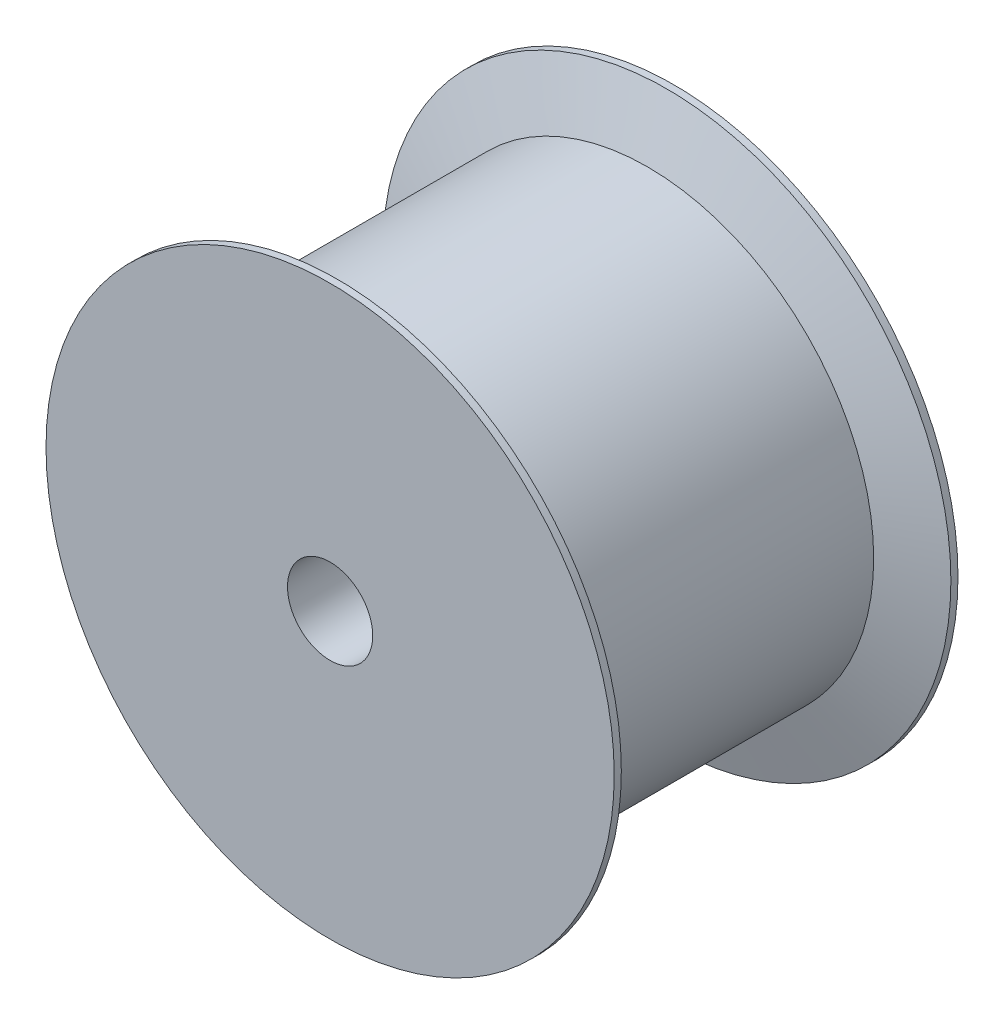
ISO-10303-21;
HEADER;
FILE_DESCRIPTION(('STEP AP214'),'2;1');
FILE_NAME('part.step','',(''),(''),'','','');
FILE_SCHEMA(('AUTOMOTIVE_DESIGN { 1 0 10303 214 1 1 1 1 }'));
ENDSEC;
DATA;
#1=APPLICATION_CONTEXT('core data for automotive mechanical design processes');
#2=APPLICATION_PROTOCOL_DEFINITION('international standard','automotive_design',2000,#1);
#3=PRODUCT_CONTEXT('',#1,'mechanical');
#4=PRODUCT('Part','Part','',(#3));
#5=PRODUCT_RELATED_PRODUCT_CATEGORY('part','',(#4));
#6=PRODUCT_DEFINITION_FORMATION('','',#4);
#7=PRODUCT_DEFINITION_CONTEXT('part definition',#1,'design');
#8=PRODUCT_DEFINITION('design','',#6,#7);
#9=PRODUCT_DEFINITION_SHAPE('','',#8);
#10=(LENGTH_UNIT() NAMED_UNIT(*) SI_UNIT(.MILLI.,.METRE.));
#11=(NAMED_UNIT(*) PLANE_ANGLE_UNIT() SI_UNIT($,.RADIAN.));
#12=(NAMED_UNIT(*) SI_UNIT($,.STERADIAN.) SOLID_ANGLE_UNIT());
#13=UNCERTAINTY_MEASURE_WITH_UNIT(LENGTH_MEASURE(1.E-05),#10,'distance_accuracy_value','');
#14=(GEOMETRIC_REPRESENTATION_CONTEXT(3) GLOBAL_UNCERTAINTY_ASSIGNED_CONTEXT((#13)) GLOBAL_UNIT_ASSIGNED_CONTEXT((#10,
#11,#12)) REPRESENTATION_CONTEXT('',''));
#15=CARTESIAN_POINT('',(0.,0.,0.));
#16=DIRECTION('',(0.,0.,1.));
#17=DIRECTION('',(1.,0.,0.));
#18=AXIS2_PLACEMENT_3D('',#15,#16,#17);
#19=CARTESIAN_POINT('',(0.,0.,24.2));
#20=DIRECTION('',(0.,0.,-1.));
#21=DIRECTION('',(-1.,0.,0.));
#22=AXIS2_PLACEMENT_3D('',#19,#20,#21);
#23=PLANE('',#22);
#24=CARTESIAN_POINT('',(0.,0.,24.2));
#25=DIRECTION('',(0.,0.,1.));
#26=DIRECTION('',(1.,0.,0.));
#27=AXIS2_PLACEMENT_3D('',#24,#25,#26);
#28=CIRCLE('',#27,3.);
#29=CARTESIAN_POINT('',(3.,0.,24.2));
#30=VERTEX_POINT('',#29);
#31=EDGE_CURVE('E57',#30,#30,#28,.T.);
#32=ORIENTED_EDGE('',*,*,#31,.F.);
#33=EDGE_LOOP('',(#32));
#34=FACE_BOUND('',#33,.T.);
#35=CARTESIAN_POINT('',(0.,0.,24.2));
#36=DIRECTION('',(0.,0.,-1.));
#37=DIRECTION('',(-1.,0.,0.));
#38=AXIS2_PLACEMENT_3D('',#35,#36,#37);
#39=CIRCLE('',#38,20.);
#40=CARTESIAN_POINT('',(-20.,0.,24.2));
#41=VERTEX_POINT('',#40);
#42=EDGE_CURVE('E10',#41,#41,#39,.T.);
#43=ORIENTED_EDGE('',*,*,#42,.F.);
#44=EDGE_LOOP('',(#43));
#45=FACE_BOUND('',#44,.T.);
#46=ADVANCED_FACE('F31',(#34,#45),#23,.F.);
#47=CARTESIAN_POINT('',(0.,0.,0.));
#48=DIRECTION('',(0.,0.,-1.));
#49=DIRECTION('',(-1.,0.,0.));
#50=AXIS2_PLACEMENT_3D('',#47,#48,#49);
#51=CYLINDRICAL_SURFACE('',#50,20.);
#52=CARTESIAN_POINT('',(0.,0.,23.7));
#53=DIRECTION('',(0.,0.,-1.));
#54=DIRECTION('',(-1.,0.,0.));
#55=AXIS2_PLACEMENT_3D('',#52,#53,#54);
#56=CIRCLE('',#55,20.);
#57=CARTESIAN_POINT('',(-20.,0.,23.7));
#58=VERTEX_POINT('',#57);
#59=EDGE_CURVE('E37',#58,#58,#56,.T.);
#60=ORIENTED_EDGE('',*,*,#59,.F.);
#61=EDGE_LOOP('',(#60));
#62=FACE_BOUND('',#61,.T.);
#63=ORIENTED_EDGE('',*,*,#42,.T.);
#64=EDGE_LOOP('',(#63));
#65=FACE_BOUND('',#64,.T.);
#66=ADVANCED_FACE('F74',(#62,#65),#51,.T.);
#67=CARTESIAN_POINT('',(0.,0.,23.7));
#68=DIRECTION('',(0.,0.,1.));
#69=DIRECTION('',(1.,0.,0.));
#70=AXIS2_PLACEMENT_3D('',#67,#68,#69);
#71=CONICAL_SURFACE('',#70,20.,1.25161835033196);
#72=CARTESIAN_POINT('',(0.,0.,22.35));
#73=DIRECTION('',(0.,0.,-1.));
#74=DIRECTION('',(-1.,0.,0.));
#75=AXIS2_PLACEMENT_3D('',#72,#73,#74);
#76=CIRCLE('',#75,15.915);
#77=CARTESIAN_POINT('',(-15.915,0.,22.35));
#78=VERTEX_POINT('',#77);
#79=EDGE_CURVE('E41',#78,#78,#76,.T.);
#80=ORIENTED_EDGE('',*,*,#79,.F.);
#81=EDGE_LOOP('',(#80));
#82=FACE_BOUND('',#81,.T.);
#83=ORIENTED_EDGE('',*,*,#59,.T.);
#84=EDGE_LOOP('',(#83));
#85=FACE_BOUND('',#84,.T.);
#86=ADVANCED_FACE('F78',(#82,#85),#71,.T.);
#87=CARTESIAN_POINT('',(0.,0.,0.));
#88=DIRECTION('',(0.,0.,-1.));
#89=DIRECTION('',(-1.,0.,0.));
#90=AXIS2_PLACEMENT_3D('',#87,#88,#89);
#91=CYLINDRICAL_SURFACE('',#90,15.915);
#92=CARTESIAN_POINT('',(0.,0.,1.85));
#93=DIRECTION('',(0.,0.,-1.));
#94=DIRECTION('',(-1.,0.,0.));
#95=AXIS2_PLACEMENT_3D('',#92,#93,#94);
#96=CIRCLE('',#95,15.915);
#97=CARTESIAN_POINT('',(-15.915,0.,1.85));
#98=VERTEX_POINT('',#97);
#99=EDGE_CURVE('E45',#98,#98,#96,.T.);
#100=ORIENTED_EDGE('',*,*,#99,.F.);
#101=EDGE_LOOP('',(#100));
#102=FACE_BOUND('',#101,.T.);
#103=ORIENTED_EDGE('',*,*,#79,.T.);
#104=EDGE_LOOP('',(#103));
#105=FACE_BOUND('',#104,.T.);
#106=ADVANCED_FACE('F83',(#102,#105),#91,.T.);
#107=CARTESIAN_POINT('',(0.,0.,1.85));
#108=DIRECTION('',(0.,0.,-1.));
#109=DIRECTION('',(-1.,0.,0.));
#110=AXIS2_PLACEMENT_3D('',#107,#108,#109);
#111=CONICAL_SURFACE('',#110,15.915,1.25161835033197);
#112=CARTESIAN_POINT('',(0.,0.,0.5));
#113=DIRECTION('',(0.,0.,-1.));
#114=DIRECTION('',(-1.,0.,0.));
#115=AXIS2_PLACEMENT_3D('',#112,#113,#114);
#116=CIRCLE('',#115,20.);
#117=CARTESIAN_POINT('',(-20.,0.,0.5));
#118=VERTEX_POINT('',#117);
#119=EDGE_CURVE('E50',#118,#118,#116,.T.);
#120=ORIENTED_EDGE('',*,*,#119,.F.);
#121=EDGE_LOOP('',(#120));
#122=FACE_BOUND('',#121,.T.);
#123=ORIENTED_EDGE('',*,*,#99,.T.);
#124=EDGE_LOOP('',(#123));
#125=FACE_BOUND('',#124,.T.);
#126=ADVANCED_FACE('F89',(#122,#125),#111,.T.);
#127=CARTESIAN_POINT('',(0.,0.,0.));
#128=DIRECTION('',(0.,0.,-1.));
#129=DIRECTION('',(-1.,0.,0.));
#130=AXIS2_PLACEMENT_3D('',#127,#128,#129);
#131=CYLINDRICAL_SURFACE('',#130,20.);
#132=CARTESIAN_POINT('',(0.,0.,0.));
#133=DIRECTION('',(0.,0.,-1.));
#134=DIRECTION('',(-1.,0.,0.));
#135=AXIS2_PLACEMENT_3D('',#132,#133,#134);
#136=CIRCLE('',#135,20.);
#137=CARTESIAN_POINT('',(-20.,0.,0.));
#138=VERTEX_POINT('',#137);
#139=EDGE_CURVE('E53',#138,#138,#136,.T.);
#140=ORIENTED_EDGE('',*,*,#139,.F.);
#141=EDGE_LOOP('',(#140));
#142=FACE_BOUND('',#141,.T.);
#143=ORIENTED_EDGE('',*,*,#119,.T.);
#144=EDGE_LOOP('',(#143));
#145=FACE_BOUND('',#144,.T.);
#146=ADVANCED_FACE('F93',(#142,#145),#131,.T.);
#147=CARTESIAN_POINT('',(0.,0.,0.));
#148=DIRECTION('',(0.,0.,1.));
#149=DIRECTION('',(1.,0.,0.));
#150=AXIS2_PLACEMENT_3D('',#147,#148,#149);
#151=PLANE('',#150);
#152=CARTESIAN_POINT('',(0.,0.,0.));
#153=DIRECTION('',(0.,0.,1.));
#154=DIRECTION('',(1.,0.,0.));
#155=AXIS2_PLACEMENT_3D('',#152,#153,#154);
#156=CIRCLE('',#155,3.);
#157=CARTESIAN_POINT('',(3.,0.,0.));
#158=VERTEX_POINT('',#157);
#159=EDGE_CURVE('E56',#158,#158,#156,.T.);
#160=ORIENTED_EDGE('',*,*,#159,.T.);
#161=EDGE_LOOP('',(#160));
#162=FACE_BOUND('',#161,.T.);
#163=ORIENTED_EDGE('',*,*,#139,.T.);
#164=EDGE_LOOP('',(#163));
#165=FACE_BOUND('',#164,.T.);
#166=ADVANCED_FACE('F63',(#162,#165),#151,.F.);
#167=CARTESIAN_POINT('',(0.,0.,0.));
#168=DIRECTION('',(0.,0.,1.));
#169=DIRECTION('',(1.,0.,0.));
#170=AXIS2_PLACEMENT_3D('',#167,#168,#169);
#171=CYLINDRICAL_SURFACE('',#170,3.);
#172=ORIENTED_EDGE('',*,*,#159,.F.);
#173=EDGE_LOOP('',(#172));
#174=FACE_BOUND('',#173,.T.);
#175=ORIENTED_EDGE('',*,*,#31,.T.);
#176=EDGE_LOOP('',(#175));
#177=FACE_BOUND('',#176,.T.);
#178=ADVANCED_FACE('F66',(#174,#177),#171,.F.);
#179=CLOSED_SHELL('',(#46,#66,#86,#106,#126,#146,#166,#178));
#180=MANIFOLD_SOLID_BREP('B2',#179);
#181=ADVANCED_BREP_SHAPE_REPRESENTATION('',(#18,#180),#14);
#182=SHAPE_DEFINITION_REPRESENTATION(#9,#181);
ENDSEC;
END-ISO-10303-21;
